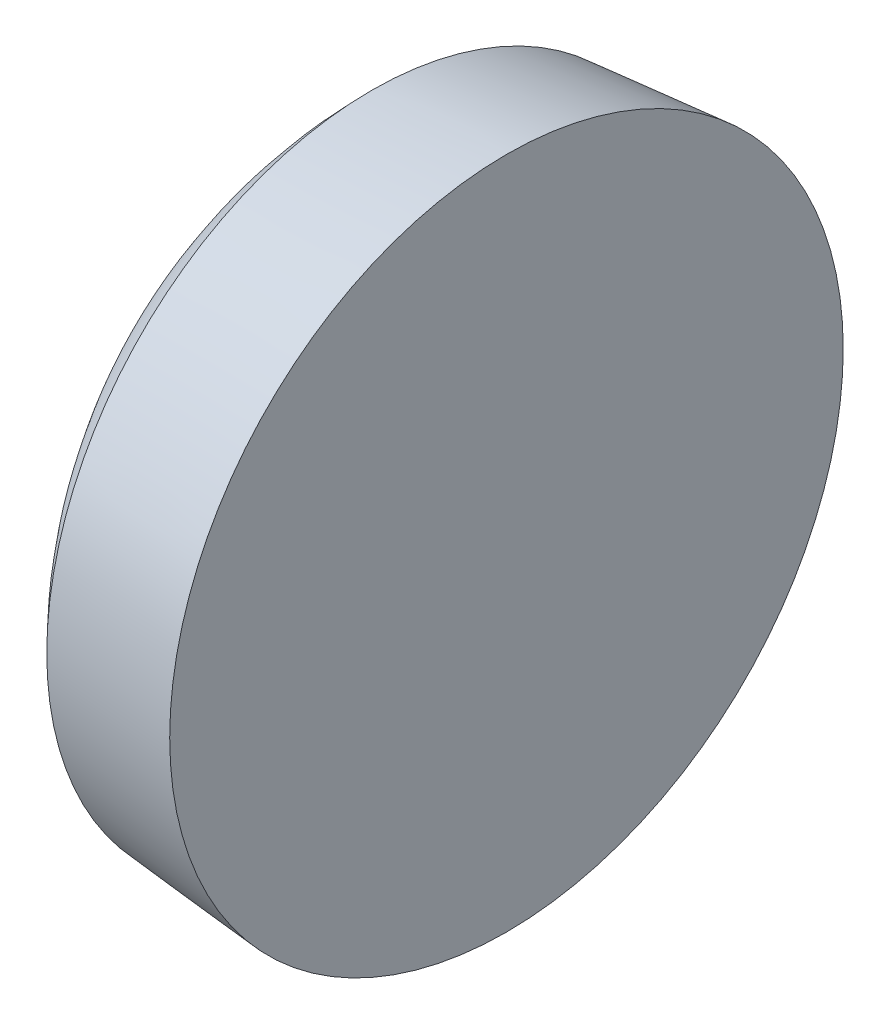
ISO-10303-21;
HEADER;
FILE_DESCRIPTION(('STEP AP214'),'2;1');
FILE_NAME('part.step','',(''),(''),'','','');
FILE_SCHEMA(('AUTOMOTIVE_DESIGN { 1 0 10303 214 1 1 1 1 }'));
ENDSEC;
DATA;
#1=APPLICATION_CONTEXT('core data for automotive mechanical design processes');
#2=APPLICATION_PROTOCOL_DEFINITION('international standard','automotive_design',2000,#1);
#3=PRODUCT_CONTEXT('',#1,'mechanical');
#4=PRODUCT('Part','Part','',(#3));
#5=PRODUCT_RELATED_PRODUCT_CATEGORY('part','',(#4));
#6=PRODUCT_DEFINITION_FORMATION('','',#4);
#7=PRODUCT_DEFINITION_CONTEXT('part definition',#1,'design');
#8=PRODUCT_DEFINITION('design','',#6,#7);
#9=PRODUCT_DEFINITION_SHAPE('','',#8);
#10=(LENGTH_UNIT() NAMED_UNIT(*) SI_UNIT(.MILLI.,.METRE.));
#11=(NAMED_UNIT(*) PLANE_ANGLE_UNIT() SI_UNIT($,.RADIAN.));
#12=(NAMED_UNIT(*) SI_UNIT($,.STERADIAN.) SOLID_ANGLE_UNIT());
#13=UNCERTAINTY_MEASURE_WITH_UNIT(LENGTH_MEASURE(1.E-05),#10,'distance_accuracy_value','');
#14=(GEOMETRIC_REPRESENTATION_CONTEXT(3) GLOBAL_UNCERTAINTY_ASSIGNED_CONTEXT((#13)) GLOBAL_UNIT_ASSIGNED_CONTEXT((#10,
#11,#12)) REPRESENTATION_CONTEXT('',''));
#15=CARTESIAN_POINT('',(0.,0.,0.));
#16=DIRECTION('',(0.,0.,1.));
#17=DIRECTION('',(1.,0.,0.));
#18=AXIS2_PLACEMENT_3D('',#15,#16,#17);
#19=CARTESIAN_POINT('',(176.066666666667,6.9,10.));
#20=DIRECTION('',(-1.,0.,0.));
#21=DIRECTION('',(0.,0.,1.));
#22=AXIS2_PLACEMENT_3D('',#19,#20,#21);
#23=PLANE('',#22);
#24=DIRECTION('',(0.,0.,-1.));
#25=VECTOR('',#24,1.);
#26=CARTESIAN_POINT('',(176.066666666667,7.85,10.));
#27=LINE('',#26,#25);
#28=CARTESIAN_POINT('',(176.066666666667,7.85,9.82));
#29=VERTEX_POINT('',#28);
#30=CARTESIAN_POINT('',(176.066666666667,7.85,10.18));
#31=VERTEX_POINT('',#30);
#32=EDGE_CURVE('E293',#29,#31,#27,.F.);
#33=ORIENTED_EDGE('',*,*,#32,.F.);
#34=DIRECTION('',(0.,1.,0.));
#35=VECTOR('',#34,1.);
#36=CARTESIAN_POINT('',(176.066666666667,6.9,9.82));
#37=LINE('',#36,#35);
#38=CARTESIAN_POINT('',(176.066666666667,7.08,9.82));
#39=VERTEX_POINT('',#38);
#40=EDGE_CURVE('E298',#39,#29,#37,.T.);
#41=ORIENTED_EDGE('',*,*,#40,.F.);
#42=DIRECTION('',(0.,0.,-1.));
#43=VECTOR('',#42,1.);
#44=CARTESIAN_POINT('',(176.066666666667,7.08,10.));
#45=LINE('',#44,#43);
#46=CARTESIAN_POINT('',(176.066666666667,7.08,9.05));
#47=VERTEX_POINT('',#46);
#48=EDGE_CURVE('E303',#47,#39,#45,.F.);
#49=ORIENTED_EDGE('',*,*,#48,.F.);
#50=DIRECTION('',(0.,1.,0.));
#51=VECTOR('',#50,1.);
#52=CARTESIAN_POINT('',(176.066666666667,6.9,9.05));
#53=LINE('',#52,#51);
#54=CARTESIAN_POINT('',(176.066666666667,6.72,9.05));
#55=VERTEX_POINT('',#54);
#56=EDGE_CURVE('E308',#55,#47,#53,.T.);
#57=ORIENTED_EDGE('',*,*,#56,.F.);
#58=DIRECTION('',(0.,0.,1.));
#59=VECTOR('',#58,1.);
#60=CARTESIAN_POINT('',(176.066666666667,6.72,10.));
#61=LINE('',#60,#59);
#62=CARTESIAN_POINT('',(176.066666666667,6.72,9.82));
#63=VERTEX_POINT('',#62);
#64=EDGE_CURVE('E313',#63,#55,#61,.F.);
#65=ORIENTED_EDGE('',*,*,#64,.F.);
#66=DIRECTION('',(0.,1.,0.));
#67=VECTOR('',#66,1.);
#68=CARTESIAN_POINT('',(176.066666666667,6.9,9.82));
#69=LINE('',#68,#67);
#70=CARTESIAN_POINT('',(176.066666666667,5.95,9.82));
#71=VERTEX_POINT('',#70);
#72=EDGE_CURVE('E318',#71,#63,#69,.T.);
#73=ORIENTED_EDGE('',*,*,#72,.F.);
#74=DIRECTION('',(0.,0.,-1.));
#75=VECTOR('',#74,1.);
#76=CARTESIAN_POINT('',(176.066666666667,5.95,10.));
#77=LINE('',#76,#75);
#78=CARTESIAN_POINT('',(176.066666666667,5.95,10.18));
#79=VERTEX_POINT('',#78);
#80=EDGE_CURVE('E267',#71,#79,#77,.F.);
#81=ORIENTED_EDGE('',*,*,#80,.T.);
#82=DIRECTION('',(0.,1.,0.));
#83=VECTOR('',#82,1.);
#84=CARTESIAN_POINT('',(176.066666666667,6.9,10.18));
#85=LINE('',#84,#83);
#86=CARTESIAN_POINT('',(176.066666666667,6.72,10.18));
#87=VERTEX_POINT('',#86);
#88=EDGE_CURVE('E264',#87,#79,#85,.F.);
#89=ORIENTED_EDGE('',*,*,#88,.F.);
#90=DIRECTION('',(0.,0.,1.));
#91=VECTOR('',#90,1.);
#92=CARTESIAN_POINT('',(176.066666666667,6.72,10.));
#93=LINE('',#92,#91);
#94=CARTESIAN_POINT('',(176.066666666667,6.72,10.95));
#95=VERTEX_POINT('',#94);
#96=EDGE_CURVE('E260',#95,#87,#93,.F.);
#97=ORIENTED_EDGE('',*,*,#96,.F.);
#98=DIRECTION('',(0.,1.,0.));
#99=VECTOR('',#98,1.);
#100=CARTESIAN_POINT('',(176.066666666667,6.9,10.95));
#101=LINE('',#100,#99);
#102=CARTESIAN_POINT('',(176.066666666667,7.08,10.95));
#103=VERTEX_POINT('',#102);
#104=EDGE_CURVE('E231',#95,#103,#101,.T.);
#105=ORIENTED_EDGE('',*,*,#104,.T.);
#106=DIRECTION('',(0.,0.,-1.));
#107=VECTOR('',#106,1.);
#108=CARTESIAN_POINT('',(176.066666666667,7.08,10.));
#109=LINE('',#108,#107);
#110=CARTESIAN_POINT('',(176.066666666667,7.08,10.18));
#111=VERTEX_POINT('',#110);
#112=EDGE_CURVE('E278',#111,#103,#109,.F.);
#113=ORIENTED_EDGE('',*,*,#112,.F.);
#114=DIRECTION('',(0.,1.,0.));
#115=VECTOR('',#114,1.);
#116=CARTESIAN_POINT('',(176.066666666667,6.9,10.18));
#117=LINE('',#116,#115);
#118=EDGE_CURVE('E288',#31,#111,#117,.F.);
#119=ORIENTED_EDGE('',*,*,#118,.F.);
#120=EDGE_LOOP('',(#33,#41,#49,#57,#65,#73,#81,#89,#97,#105,#113,#119));
#121=FACE_BOUND('',#120,.T.);
#122=ADVANCED_FACE('F17',(#121),#23,.T.);
#123=CARTESIAN_POINT('',(175.466666666667,6.72,10.));
#124=DIRECTION('',(0.,1.,0.));
#125=DIRECTION('',(0.,0.,1.));
#126=AXIS2_PLACEMENT_3D('',#123,#124,#125);
#127=PLANE('',#126);
#128=DIRECTION('',(1.,0.,0.));
#129=VECTOR('',#128,1.);
#130=CARTESIAN_POINT('',(175.466666666667,6.72,10.95));
#131=LINE('',#130,#129);
#132=CARTESIAN_POINT('',(175.043762143476,6.72,10.9500000000001));
#133=VERTEX_POINT('',#132);
#134=EDGE_CURVE('E89',#133,#95,#131,.T.);
#135=ORIENTED_EDGE('',*,*,#134,.T.);
#136=ORIENTED_EDGE('',*,*,#96,.T.);
#137=DIRECTION('',(-1.,0.,0.));
#138=VECTOR('',#137,1.);
#139=CARTESIAN_POINT('',(175.466666666667,6.72,10.18));
#140=LINE('',#139,#138);
#141=CARTESIAN_POINT('',(174.878569096873,6.71999999999999,10.18));
#142=VERTEX_POINT('',#141);
#143=EDGE_CURVE('E224',#142,#87,#140,.F.);
#144=ORIENTED_EDGE('',*,*,#143,.F.);
#145=CARTESIAN_POINT('',(175.043762143476,6.72,10.9500000000001));
#146=CARTESIAN_POINT('',(175.032217129282,6.72,10.9189995540507));
#147=CARTESIAN_POINT('',(175.021237746898,6.72,10.8877884938069));
#148=CARTESIAN_POINT('',(175.00046454836,6.72,10.825110453647));
#149=CARTESIAN_POINT('',(174.990666241349,6.72,10.7936449620742));
#150=CARTESIAN_POINT('',(174.972242700709,6.72,10.7304618501357));
#151=CARTESIAN_POINT('',(174.96361446108,6.72,10.6987451062673));
#152=CARTESIAN_POINT('',(174.947522711913,6.72,10.6350619663156));
#153=CARTESIAN_POINT('',(174.940057683091,6.72,10.6030959541243));
#154=CARTESIAN_POINT('',(174.926288504705,6.72,10.5389148788569));
#155=CARTESIAN_POINT('',(174.91998435514,6.72,10.5066998157809));
#156=CARTESIAN_POINT('',(174.908537607774,6.72,10.4420201537525));
#157=CARTESIAN_POINT('',(174.903396553029,6.72,10.4095552817086));
#158=CARTESIAN_POINT('',(174.894281504356,6.72,10.3443751591894));
#159=CARTESIAN_POINT('',(174.890310611427,6.72,10.3116594750373));
#160=CARTESIAN_POINT('',(174.883545624518,6.72,10.2459761632456));
#161=CARTESIAN_POINT('',(174.880756236699,6.72,10.2130080508538));
#162=CARTESIAN_POINT('',(174.878569096873,6.72,10.18));
#163=B_SPLINE_CURVE_WITH_KNOTS('',3,(#145,#146,#147,#148,#149,#150,#151,#152,#153,#154,#155,
#156,#157,#158,#159,#160,#161,#162),.UNSPECIFIED.,.F.,.F.,(4,2,2,2,2,2,2,2,4),(0.,
0.0992357442434378,0.198081387639297,0.296668072480536,0.39512489269415,0.493581712907769,
0.592168397749008,0.69101404114487,0.790249785388305),.UNSPECIFIED.);
#164=EDGE_CURVE('E20',#133,#142,#163,.T.);
#165=ORIENTED_EDGE('',*,*,#164,.F.);
#166=EDGE_LOOP('',(#135,#136,#144,#165));
#167=FACE_BOUND('',#166,.T.);
#168=ADVANCED_FACE('F221',(#167),#127,.T.);
#169=CARTESIAN_POINT('',(175.466666666667,6.9,10.18));
#170=DIRECTION('',(0.,0.,-1.));
#171=DIRECTION('',(-1.,0.,0.));
#172=AXIS2_PLACEMENT_3D('',#169,#170,#171);
#173=PLANE('',#172);
#174=ORIENTED_EDGE('',*,*,#88,.T.);
#175=DIRECTION('',(1.,0.,0.));
#176=VECTOR('',#175,1.);
#177=CARTESIAN_POINT('',(175.466666666667,5.95,10.18));
#178=LINE('',#177,#176);
#179=CARTESIAN_POINT('',(175.043762143476,5.95,10.18));
#180=VERTEX_POINT('',#179);
#181=EDGE_CURVE('E324',#79,#180,#178,.F.);
#182=ORIENTED_EDGE('',*,*,#181,.T.);
#183=CARTESIAN_POINT('',(174.878569096873,6.71999999999997,10.18));
#184=CARTESIAN_POINT('',(174.884223275561,6.63440991744415,10.18));
#185=CARTESIAN_POINT('',(174.893954762962,6.54909652262228,10.18));
#186=CARTESIAN_POINT('',(174.921321880478,6.38034093840227,10.18));
#187=CARTESIAN_POINT('',(174.938903434517,6.29688998051799,10.18));
#188=CARTESIAN_POINT('',(174.983632564079,6.12495750840946,10.18));
#189=CARTESIAN_POINT('',(175.011468627175,6.03665468899643,10.18));
#190=CARTESIAN_POINT('',(175.043762143476,5.94999999999987,10.18));
#191=B_SPLINE_CURVE_WITH_KNOTS('',3,(#183,#184,#185,#186,#187,#188,#189,#190),.UNSPECIFIED.,.F.,
.F.,(4,2,2,4),(0.,0.257221658829358,0.512698117737389,0.789983486231724),.UNSPECIFIED.);
#192=EDGE_CURVE('E213',#142,#180,#191,.T.);
#193=ORIENTED_EDGE('',*,*,#192,.F.);
#194=ORIENTED_EDGE('',*,*,#143,.T.);
#195=EDGE_LOOP('',(#174,#182,#193,#194));
#196=FACE_BOUND('',#195,.T.);
#197=ADVANCED_FACE('F204',(#196),#173,.T.);
#198=CARTESIAN_POINT('',(175.466666666667,5.95,10.));
#199=DIRECTION('',(0.,-1.,0.));
#200=DIRECTION('',(0.,0.,-1.));
#201=AXIS2_PLACEMENT_3D('',#198,#199,#200);
#202=PLANE('',#201);
#203=ORIENTED_EDGE('',*,*,#181,.F.);
#204=ORIENTED_EDGE('',*,*,#80,.F.);
#205=DIRECTION('',(1.,0.,0.));
#206=VECTOR('',#205,1.);
#207=CARTESIAN_POINT('',(175.466666666667,5.95,9.82));
#208=LINE('',#207,#206);
#209=CARTESIAN_POINT('',(175.043762143476,5.94999999999993,9.82));
#210=VERTEX_POINT('',#209);
#211=EDGE_CURVE('E320',#210,#71,#208,.T.);
#212=ORIENTED_EDGE('',*,*,#211,.F.);
#213=CARTESIAN_POINT('',(175.043762143476,5.95,10.18));
#214=CARTESIAN_POINT('',(175.039533747777,5.94999999999998,10.12));
#215=CARTESIAN_POINT('',(175.037419549928,5.94999999999998,10.06));
#216=CARTESIAN_POINT('',(175.037419549928,5.95000000000002,9.93999999999995));
#217=CARTESIAN_POINT('',(175.039533747777,5.95000000000006,9.87999999999993));
#218=CARTESIAN_POINT('',(175.043762143476,5.95000000000011,9.81999999999991));
#219=B_SPLINE_CURVE_WITH_KNOTS('',3,(#213,#214,#215,#216,#217,#218),.UNSPECIFIED.,.F.,.F.,(4,2,
4),(0.,0.180111711148745,0.36022342229749),.UNSPECIFIED.);
#220=EDGE_CURVE('E207',#180,#210,#219,.T.);
#221=ORIENTED_EDGE('',*,*,#220,.F.);
#222=EDGE_LOOP('',(#203,#204,#212,#221));
#223=FACE_BOUND('',#222,.T.);
#224=ADVANCED_FACE('F199',(#223),#202,.F.);
#225=CARTESIAN_POINT('',(175.466666666667,6.9,9.82));
#226=DIRECTION('',(0.,0.,1.));
#227=DIRECTION('',(1.,0.,0.));
#228=AXIS2_PLACEMENT_3D('',#225,#226,#227);
#229=PLANE('',#228);
#230=ORIENTED_EDGE('',*,*,#72,.T.);
#231=DIRECTION('',(1.,0.,0.));
#232=VECTOR('',#231,1.);
#233=CARTESIAN_POINT('',(175.466666666667,6.72,9.82));
#234=LINE('',#233,#232);
#235=CARTESIAN_POINT('',(174.878569096873,6.72,9.81999999999998));
#236=VERTEX_POINT('',#235);
#237=EDGE_CURVE('E315',#236,#63,#234,.T.);
#238=ORIENTED_EDGE('',*,*,#237,.F.);
#239=CARTESIAN_POINT('',(175.043762143476,5.94999999999987,9.82));
#240=CARTESIAN_POINT('',(175.032217129282,5.98100044594929,9.82));
#241=CARTESIAN_POINT('',(175.021237746898,6.01221150619315,9.82));
#242=CARTESIAN_POINT('',(175.00046454836,6.07488954635304,9.82));
#243=CARTESIAN_POINT('',(174.990666241349,6.10635503792584,9.82));
#244=CARTESIAN_POINT('',(174.972242700709,6.1695381498643,9.82));
#245=CARTESIAN_POINT('',(174.96361446108,6.20125489373266,9.82));
#246=CARTESIAN_POINT('',(174.947522711913,6.26493803368441,9.82));
#247=CARTESIAN_POINT('',(174.940057683091,6.29690404587573,9.82));
#248=CARTESIAN_POINT('',(174.926288504705,6.36108512114309,9.82));
#249=CARTESIAN_POINT('',(174.91998435514,6.39330018421913,9.82));
#250=CARTESIAN_POINT('',(174.908537607774,6.45797984624754,9.82));
#251=CARTESIAN_POINT('',(174.903396553029,6.49044471829137,9.82));
#252=CARTESIAN_POINT('',(174.894281504356,6.55562484081063,9.82));
#253=CARTESIAN_POINT('',(174.890310611427,6.58834052496272,9.82));
#254=CARTESIAN_POINT('',(174.883545624518,6.65402383675436,9.82));
#255=CARTESIAN_POINT('',(174.880756236699,6.68699194914618,9.82));
#256=CARTESIAN_POINT('',(174.878569096873,6.71999999999997,9.82));
#257=B_SPLINE_CURVE_WITH_KNOTS('',3,(#239,#240,#241,#242,#243,#244,#245,#246,#247,#248,#249,
#250,#251,#252,#253,#254,#255,#256),.UNSPECIFIED.,.F.,.F.,(4,2,2,2,2,2,2,2,4),(0.,
0.0992357442434386,0.1980813876393,0.296668072480538,0.395124892694152,0.493581712907769,
0.592168397749011,0.691014041144872,0.790249785388307),.UNSPECIFIED.);
#258=EDGE_CURVE('E184',#210,#236,#257,.T.);
#259=ORIENTED_EDGE('',*,*,#258,.F.);
#260=ORIENTED_EDGE('',*,*,#211,.T.);
#261=EDGE_LOOP('',(#230,#238,#259,#260));
#262=FACE_BOUND('',#261,.T.);
#263=ADVANCED_FACE('F194',(#262),#229,.T.);
#264=CARTESIAN_POINT('',(175.466666666667,6.72,10.));
#265=DIRECTION('',(0.,1.,0.));
#266=DIRECTION('',(0.,0.,1.));
#267=AXIS2_PLACEMENT_3D('',#264,#265,#266);
#268=PLANE('',#267);
#269=DIRECTION('',(1.,0.,0.));
#270=VECTOR('',#269,1.);
#271=CARTESIAN_POINT('',(175.466666666667,6.72,9.05));
#272=LINE('',#271,#270);
#273=CARTESIAN_POINT('',(175.043762143476,6.72,9.05));
#274=VERTEX_POINT('',#273);
#275=EDGE_CURVE('E310',#274,#55,#272,.T.);
#276=ORIENTED_EDGE('',*,*,#275,.F.);
#277=CARTESIAN_POINT('',(174.878569096873,6.72,9.81999999999997));
#278=CARTESIAN_POINT('',(174.884223275561,6.72,9.73440991744415));
#279=CARTESIAN_POINT('',(174.893954762962,6.72,9.64909652262228));
#280=CARTESIAN_POINT('',(174.921321880478,6.72,9.48034093840227));
#281=CARTESIAN_POINT('',(174.938903434517,6.72,9.39688998051799));
#282=CARTESIAN_POINT('',(174.983632564079,6.72,9.22495750840946));
#283=CARTESIAN_POINT('',(175.011468627175,6.72,9.13665468899643));
#284=CARTESIAN_POINT('',(175.043762143476,6.72,9.04999999999987));
#285=B_SPLINE_CURVE_WITH_KNOTS('',3,(#277,#278,#279,#280,#281,#282,#283,#284),.UNSPECIFIED.,.F.,
.F.,(4,2,2,4),(0.,0.257221658829358,0.512698117737392,0.78998348623172),.UNSPECIFIED.);
#286=EDGE_CURVE('E176',#236,#274,#285,.T.);
#287=ORIENTED_EDGE('',*,*,#286,.F.);
#288=ORIENTED_EDGE('',*,*,#237,.T.);
#289=ORIENTED_EDGE('',*,*,#64,.T.);
#290=EDGE_LOOP('',(#276,#287,#288,#289));
#291=FACE_BOUND('',#290,.T.);
#292=ADVANCED_FACE('F191',(#291),#268,.T.);
#293=CARTESIAN_POINT('',(175.466666666667,6.9,9.05));
#294=DIRECTION('',(0.,0.,1.));
#295=DIRECTION('',(1.,0.,0.));
#296=AXIS2_PLACEMENT_3D('',#293,#294,#295);
#297=PLANE('',#296);
#298=DIRECTION('',(1.,0.,0.));
#299=VECTOR('',#298,1.);
#300=CARTESIAN_POINT('',(175.466666666667,7.08,9.05));
#301=LINE('',#300,#299);
#302=CARTESIAN_POINT('',(175.043762143476,7.08,9.04999999999994));
#303=VERTEX_POINT('',#302);
#304=EDGE_CURVE('E305',#303,#47,#301,.T.);
#305=ORIENTED_EDGE('',*,*,#304,.F.);
#306=CARTESIAN_POINT('',(175.043762143476,7.08,9.05));
#307=CARTESIAN_POINT('',(175.037419549928,6.99011174581202,9.05));
#308=CARTESIAN_POINT('',(175.037419549928,6.9,9.05));
#309=B_SPLINE_CURVE_WITH_KNOTS('',2,(#306,#307,#308),.UNSPECIFIED.,.F.,.F.,(3,3),(0.,1.),.UNSPECIFIED.);
#310=CARTESIAN_POINT('',(175.037419549928,6.9,9.05));
#311=VERTEX_POINT('',#310);
#312=EDGE_CURVE('E175',#311,#303,#309,.F.);
#313=ORIENTED_EDGE('',*,*,#312,.F.);
#314=CARTESIAN_POINT('',(175.037419549928,6.9,9.05));
#315=CARTESIAN_POINT('',(175.037419549928,6.80988825418797,9.05));
#316=CARTESIAN_POINT('',(175.043762143476,6.72,9.05));
#317=B_SPLINE_CURVE_WITH_KNOTS('',2,(#314,#315,#316),.UNSPECIFIED.,.F.,.F.,(3,3),(0.,1.),.UNSPECIFIED.);
#318=EDGE_CURVE('E183',#274,#311,#317,.F.);
#319=ORIENTED_EDGE('',*,*,#318,.F.);
#320=ORIENTED_EDGE('',*,*,#275,.T.);
#321=ORIENTED_EDGE('',*,*,#56,.T.);
#322=EDGE_LOOP('',(#305,#313,#319,#320,#321));
#323=FACE_BOUND('',#322,.T.);
#324=ADVANCED_FACE('F164',(#323),#297,.T.);
#325=CARTESIAN_POINT('',(175.466666666667,7.08,10.));
#326=DIRECTION('',(0.,-1.,0.));
#327=DIRECTION('',(0.,0.,-1.));
#328=AXIS2_PLACEMENT_3D('',#325,#326,#327);
#329=PLANE('',#328);
#330=ORIENTED_EDGE('',*,*,#304,.T.);
#331=ORIENTED_EDGE('',*,*,#48,.T.);
#332=DIRECTION('',(1.,0.,0.));
#333=VECTOR('',#332,1.);
#334=CARTESIAN_POINT('',(175.466666666667,7.08,9.82));
#335=LINE('',#334,#333);
#336=CARTESIAN_POINT('',(174.878569096873,7.08000000000002,9.82));
#337=VERTEX_POINT('',#336);
#338=EDGE_CURVE('E300',#337,#39,#335,.T.);
#339=ORIENTED_EDGE('',*,*,#338,.F.);
#340=CARTESIAN_POINT('',(175.043762143476,7.08,9.04999999999987));
#341=CARTESIAN_POINT('',(175.032217129282,7.08,9.08100044594929));
#342=CARTESIAN_POINT('',(175.021237746898,7.08,9.11221150619315));
#343=CARTESIAN_POINT('',(175.00046454836,7.08,9.17488954635304));
#344=CARTESIAN_POINT('',(174.990666241349,7.08,9.20635503792584));
#345=CARTESIAN_POINT('',(174.972242700709,7.08,9.2695381498643));
#346=CARTESIAN_POINT('',(174.96361446108,7.08,9.30125489373266));
#347=CARTESIAN_POINT('',(174.947522711913,7.08,9.36493803368441));
#348=CARTESIAN_POINT('',(174.940057683091,7.08,9.39690404587573));
#349=CARTESIAN_POINT('',(174.926288504705,7.08,9.46108512114309));
#350=CARTESIAN_POINT('',(174.91998435514,7.08,9.49330018421913));
#351=CARTESIAN_POINT('',(174.908537607774,7.08,9.55797984624754));
#352=CARTESIAN_POINT('',(174.903396553029,7.08,9.59044471829137));
#353=CARTESIAN_POINT('',(174.894281504356,7.08,9.65562484081063));
#354=CARTESIAN_POINT('',(174.890310611427,7.08,9.68834052496272));
#355=CARTESIAN_POINT('',(174.883545624518,7.08,9.75402383675435));
#356=CARTESIAN_POINT('',(174.880756236699,7.08,9.78699194914618));
#357=CARTESIAN_POINT('',(174.878569096873,7.08,9.81999999999997));
#358=B_SPLINE_CURVE_WITH_KNOTS('',3,(#340,#341,#342,#343,#344,#345,#346,#347,#348,#349,#350,
#351,#352,#353,#354,#355,#356,#357),.UNSPECIFIED.,.F.,.F.,(4,2,2,2,2,2,2,2,4),(0.,
0.0992357442434378,0.198081387639297,0.296668072480536,0.39512489269415,0.49358171290777,
0.592168397749008,0.691014041144872,0.790249785388305),.UNSPECIFIED.);
#359=EDGE_CURVE('E168',#303,#337,#358,.T.);
#360=ORIENTED_EDGE('',*,*,#359,.F.);
#361=EDGE_LOOP('',(#330,#331,#339,#360));
#362=FACE_BOUND('',#361,.T.);
#363=ADVANCED_FACE('F159',(#362),#329,.T.);
#364=CARTESIAN_POINT('',(175.466666666667,6.9,9.82));
#365=DIRECTION('',(0.,0.,1.));
#366=DIRECTION('',(1.,0.,0.));
#367=AXIS2_PLACEMENT_3D('',#364,#365,#366);
#368=PLANE('',#367);
#369=ORIENTED_EDGE('',*,*,#40,.T.);
#370=DIRECTION('',(1.,0.,0.));
#371=VECTOR('',#370,1.);
#372=CARTESIAN_POINT('',(175.466666666667,7.85,9.82));
#373=LINE('',#372,#371);
#374=CARTESIAN_POINT('',(175.043762143476,7.85,9.81999999999998));
#375=VERTEX_POINT('',#374);
#376=EDGE_CURVE('E295',#375,#29,#373,.T.);
#377=ORIENTED_EDGE('',*,*,#376,.F.);
#378=CARTESIAN_POINT('',(174.878569096873,7.08000000000003,9.82));
#379=CARTESIAN_POINT('',(174.884223275561,7.16559008255585,9.82));
#380=CARTESIAN_POINT('',(174.893954762962,7.25090347737773,9.82));
#381=CARTESIAN_POINT('',(174.921321880478,7.41965906159774,9.82));
#382=CARTESIAN_POINT('',(174.938903434517,7.50311001948201,9.82));
#383=CARTESIAN_POINT('',(174.983632564079,7.67504249159054,9.82));
#384=CARTESIAN_POINT('',(175.011468627175,7.76334531100356,9.82));
#385=CARTESIAN_POINT('',(175.043762143476,7.85000000000013,9.82));
#386=B_SPLINE_CURVE_WITH_KNOTS('',3,(#378,#379,#380,#381,#382,#383,#384,#385),.UNSPECIFIED.,.F.,
.F.,(4,2,2,4),(0.,0.25722165882936,0.512698117737392,0.789983486231716),.UNSPECIFIED.);
#387=EDGE_CURVE('E144',#337,#375,#386,.T.);
#388=ORIENTED_EDGE('',*,*,#387,.F.);
#389=ORIENTED_EDGE('',*,*,#338,.T.);
#390=EDGE_LOOP('',(#369,#377,#388,#389));
#391=FACE_BOUND('',#390,.T.);
#392=ADVANCED_FACE('F154',(#391),#368,.T.);
#393=CARTESIAN_POINT('',(175.466666666667,7.85,10.));
#394=DIRECTION('',(0.,-1.,0.));
#395=DIRECTION('',(0.,0.,-1.));
#396=AXIS2_PLACEMENT_3D('',#393,#394,#395);
#397=PLANE('',#396);
#398=ORIENTED_EDGE('',*,*,#32,.T.);
#399=DIRECTION('',(-1.,0.,0.));
#400=VECTOR('',#399,1.);
#401=CARTESIAN_POINT('',(175.466666666667,7.85,10.18));
#402=LINE('',#401,#400);
#403=CARTESIAN_POINT('',(175.043762143476,7.85000000000007,10.18));
#404=VERTEX_POINT('',#403);
#405=EDGE_CURVE('E290',#404,#31,#402,.F.);
#406=ORIENTED_EDGE('',*,*,#405,.F.);
#407=CARTESIAN_POINT('',(175.043762143476,7.85,9.81999999999998));
#408=CARTESIAN_POINT('',(175.039533747777,7.85000000000001,9.88));
#409=CARTESIAN_POINT('',(175.037419549928,7.85000000000001,9.94000000000001));
#410=CARTESIAN_POINT('',(175.037419549928,7.84999999999999,10.0600000000001));
#411=CARTESIAN_POINT('',(175.039533747777,7.84999999999997,10.1200000000001));
#412=CARTESIAN_POINT('',(175.043762143476,7.84999999999994,10.1800000000001));
#413=B_SPLINE_CURVE_WITH_KNOTS('',3,(#407,#408,#409,#410,#411,#412),.UNSPECIFIED.,.F.,.F.,(4,2,
4),(0.,0.180111711148747,0.360223422297492),.UNSPECIFIED.);
#414=EDGE_CURVE('E137',#375,#404,#413,.T.);
#415=ORIENTED_EDGE('',*,*,#414,.F.);
#416=ORIENTED_EDGE('',*,*,#376,.T.);
#417=EDGE_LOOP('',(#398,#406,#415,#416));
#418=FACE_BOUND('',#417,.T.);
#419=ADVANCED_FACE('F151',(#418),#397,.T.);
#420=CARTESIAN_POINT('',(175.466666666667,6.9,10.18));
#421=DIRECTION('',(0.,0.,-1.));
#422=DIRECTION('',(-1.,0.,0.));
#423=AXIS2_PLACEMENT_3D('',#420,#421,#422);
#424=PLANE('',#423);
#425=ORIENTED_EDGE('',*,*,#118,.T.);
#426=DIRECTION('',(1.,0.,0.));
#427=VECTOR('',#426,1.);
#428=CARTESIAN_POINT('',(175.466666666667,7.08,10.18));
#429=LINE('',#428,#427);
#430=CARTESIAN_POINT('',(174.878569096873,7.08,10.18));
#431=VERTEX_POINT('',#430);
#432=EDGE_CURVE('E280',#431,#111,#429,.T.);
#433=ORIENTED_EDGE('',*,*,#432,.F.);
#434=CARTESIAN_POINT('',(175.043762143476,7.85000000000013,10.18));
#435=CARTESIAN_POINT('',(175.032217129282,7.81899955405071,10.18));
#436=CARTESIAN_POINT('',(175.021237746898,7.78778849380685,10.18));
#437=CARTESIAN_POINT('',(175.00046454836,7.72511045364696,10.18));
#438=CARTESIAN_POINT('',(174.990666241349,7.69364496207416,10.18));
#439=CARTESIAN_POINT('',(174.972242700709,7.6304618501357,10.18));
#440=CARTESIAN_POINT('',(174.96361446108,7.59874510626734,10.18));
#441=CARTESIAN_POINT('',(174.947522711913,7.53506196631559,10.18));
#442=CARTESIAN_POINT('',(174.940057683091,7.50309595412427,10.18));
#443=CARTESIAN_POINT('',(174.926288504705,7.43891487885691,10.18));
#444=CARTESIAN_POINT('',(174.91998435514,7.40669981578087,10.18));
#445=CARTESIAN_POINT('',(174.908537607774,7.34202015375246,10.18));
#446=CARTESIAN_POINT('',(174.903396553029,7.30955528170863,10.18));
#447=CARTESIAN_POINT('',(174.894281504356,7.24437515918937,10.18));
#448=CARTESIAN_POINT('',(174.890310611427,7.21165947503728,10.18));
#449=CARTESIAN_POINT('',(174.883545624518,7.14597616324565,10.18));
#450=CARTESIAN_POINT('',(174.880756236699,7.11300805085382,10.18));
#451=CARTESIAN_POINT('',(174.878569096873,7.08000000000003,10.18));
#452=B_SPLINE_CURVE_WITH_KNOTS('',3,(#434,#435,#436,#437,#438,#439,#440,#441,#442,#443,#444,
#445,#446,#447,#448,#449,#450,#451),.UNSPECIFIED.,.F.,.F.,(4,2,2,2,2,2,2,2,4),(0.,
0.0992357442434378,0.198081387639298,0.296668072480535,0.395124892694149,0.493581712907766,
0.592168397749007,0.691014041144869,0.790249785388302),.UNSPECIFIED.);
#453=EDGE_CURVE('E100',#404,#431,#452,.T.);
#454=ORIENTED_EDGE('',*,*,#453,.F.);
#455=ORIENTED_EDGE('',*,*,#405,.T.);
#456=EDGE_LOOP('',(#425,#433,#454,#455));
#457=FACE_BOUND('',#456,.T.);
#458=ADVANCED_FACE('F123',(#457),#424,.T.);
#459=CARTESIAN_POINT('',(175.466666666667,7.08,10.));
#460=DIRECTION('',(0.,-1.,0.));
#461=DIRECTION('',(0.,0.,-1.));
#462=AXIS2_PLACEMENT_3D('',#459,#460,#461);
#463=PLANE('',#462);
#464=DIRECTION('',(1.,0.,0.));
#465=VECTOR('',#464,1.);
#466=CARTESIAN_POINT('',(175.466666666667,7.08,10.95));
#467=LINE('',#466,#465);
#468=CARTESIAN_POINT('',(175.043762143476,7.08,10.95));
#469=VERTEX_POINT('',#468);
#470=EDGE_CURVE('E40',#103,#469,#467,.F.);
#471=ORIENTED_EDGE('',*,*,#470,.T.);
#472=CARTESIAN_POINT('',(174.878569096873,7.08,10.18));
#473=CARTESIAN_POINT('',(174.884223275561,7.08,10.2655900825559));
#474=CARTESIAN_POINT('',(174.893954762962,7.08,10.3509034773777));
#475=CARTESIAN_POINT('',(174.921321880478,7.08,10.5196590615977));
#476=CARTESIAN_POINT('',(174.938903434517,7.08,10.603110019482));
#477=CARTESIAN_POINT('',(174.983632564079,7.08,10.7750424915905));
#478=CARTESIAN_POINT('',(175.011468627175,7.08,10.8633453110036));
#479=CARTESIAN_POINT('',(175.043762143476,7.08,10.9500000000001));
#480=B_SPLINE_CURVE_WITH_KNOTS('',3,(#472,#473,#474,#475,#476,#477,#478,#479),.UNSPECIFIED.,.F.,
.F.,(4,2,2,4),(0.,0.257221658829358,0.512698117737393,0.789983486231719),.UNSPECIFIED.);
#481=EDGE_CURVE('E96',#431,#469,#480,.T.);
#482=ORIENTED_EDGE('',*,*,#481,.F.);
#483=ORIENTED_EDGE('',*,*,#432,.T.);
#484=ORIENTED_EDGE('',*,*,#112,.T.);
#485=EDGE_LOOP('',(#471,#482,#483,#484));
#486=FACE_BOUND('',#485,.T.);
#487=ADVANCED_FACE('F115',(#486),#463,.T.);
#488=CARTESIAN_POINT('',(175.466666666667,6.9,10.95));
#489=DIRECTION('',(0.,0.,1.));
#490=DIRECTION('',(1.,0.,0.));
#491=AXIS2_PLACEMENT_3D('',#488,#489,#490);
#492=PLANE('',#491);
#493=ORIENTED_EDGE('',*,*,#470,.F.);
#494=ORIENTED_EDGE('',*,*,#104,.F.);
#495=ORIENTED_EDGE('',*,*,#134,.F.);
#496=CARTESIAN_POINT('',(175.037419549928,6.9,10.95));
#497=CARTESIAN_POINT('',(175.037419549928,6.80988825418797,10.95));
#498=CARTESIAN_POINT('',(175.043762143476,6.72,10.95));
#499=B_SPLINE_CURVE_WITH_KNOTS('',2,(#496,#497,#498),.UNSPECIFIED.,.F.,.F.,(3,3),(0.,1.),.UNSPECIFIED.);
#500=CARTESIAN_POINT('',(175.037419549928,6.9,10.95));
#501=VERTEX_POINT('',#500);
#502=EDGE_CURVE('E82',#501,#133,#499,.T.);
#503=ORIENTED_EDGE('',*,*,#502,.F.);
#504=CARTESIAN_POINT('',(175.043762143476,7.08,10.95));
#505=CARTESIAN_POINT('',(175.037419549928,6.99011174581202,10.95));
#506=CARTESIAN_POINT('',(175.037419549928,6.9,10.95));
#507=B_SPLINE_CURVE_WITH_KNOTS('',2,(#504,#505,#506),.UNSPECIFIED.,.F.,.F.,(3,3),(0.,1.),.UNSPECIFIED.);
#508=EDGE_CURVE('E85',#469,#501,#507,.T.);
#509=ORIENTED_EDGE('',*,*,#508,.F.);
#510=EDGE_LOOP('',(#493,#494,#495,#503,#509));
#511=FACE_BOUND('',#510,.T.);
#512=ADVANCED_FACE('F84',(#511),#492,.F.);
#513=CARTESIAN_POINT('',(177.594751046113,6.9,10.));
#514=DIRECTION('',(1.,0.,0.));
#515=DIRECTION('',(0.,1.,0.));
#516=AXIS2_PLACEMENT_3D('',#513,#514,#515);
#517=SPHERICAL_SURFACE('',#516,2.72808437944638);
#518=CARTESIAN_POINT('',(175.666666666643,6.9,10.));
#519=DIRECTION('',(1.,0.,0.));
#520=DIRECTION('',(0.,0.,1.));
#521=AXIS2_PLACEMENT_3D('',#518,#519,#520);
#522=CIRCLE('',#521,1.93000906918229);
#523=CARTESIAN_POINT('',(175.666666666643,6.90000000000007,11.9300090691823));
#524=VERTEX_POINT('',#523);
#525=EDGE_CURVE('E31',#524,#524,#522,.T.);
#526=ORIENTED_EDGE('',*,*,#525,.F.);
#527=EDGE_LOOP('',(#526));
#528=FACE_BOUND('',#527,.T.);
#529=ORIENTED_EDGE('',*,*,#481,.T.);
#530=ORIENTED_EDGE('',*,*,#508,.T.);
#531=ORIENTED_EDGE('',*,*,#502,.T.);
#532=ORIENTED_EDGE('',*,*,#164,.T.);
#533=ORIENTED_EDGE('',*,*,#192,.T.);
#534=ORIENTED_EDGE('',*,*,#220,.T.);
#535=ORIENTED_EDGE('',*,*,#258,.T.);
#536=ORIENTED_EDGE('',*,*,#286,.T.);
#537=ORIENTED_EDGE('',*,*,#318,.T.);
#538=ORIENTED_EDGE('',*,*,#312,.T.);
#539=ORIENTED_EDGE('',*,*,#359,.T.);
#540=ORIENTED_EDGE('',*,*,#387,.T.);
#541=ORIENTED_EDGE('',*,*,#414,.T.);
#542=ORIENTED_EDGE('',*,*,#453,.T.);
#543=EDGE_LOOP('',(#529,#530,#531,#532,#533,#534,#535,#536,#537,#538,#539,#540,#541,#542));
#544=FACE_BOUND('',#543,.T.);
#545=ADVANCED_FACE('F94',(#528,#544),#517,.T.);
#546=CARTESIAN_POINT('',(176.46666666667,6.9,10.));
#547=DIRECTION('',(1.,0.,0.));
#548=DIRECTION('',(0.,0.,-1.));
#549=AXIS2_PLACEMENT_3D('',#546,#547,#548);
#550=CONICAL_SURFACE('',#549,2.00000000000045,0.0872664625936403);
#551=CARTESIAN_POINT('',(176.46666666667,6.9,10.));
#552=DIRECTION('',(1.,0.,0.));
#553=DIRECTION('',(0.,0.,-1.));
#554=AXIS2_PLACEMENT_3D('',#551,#552,#553);
#555=CIRCLE('',#554,2.00000000000045);
#556=CARTESIAN_POINT('',(176.46666666667,6.9,7.99999999999955));
#557=VERTEX_POINT('',#556);
#558=EDGE_CURVE('E11',#557,#557,#555,.T.);
#559=ORIENTED_EDGE('',*,*,#558,.F.);
#560=EDGE_LOOP('',(#559));
#561=FACE_BOUND('',#560,.T.);
#562=ORIENTED_EDGE('',*,*,#525,.T.);
#563=EDGE_LOOP('',(#562));
#564=FACE_BOUND('',#563,.T.);
#565=ADVANCED_FACE('F402',(#561,#564),#550,.T.);
#566=CARTESIAN_POINT('',(176.466666666667,6.9,11.));
#567=DIRECTION('',(1.,0.,0.));
#568=DIRECTION('',(0.,0.,-1.));
#569=AXIS2_PLACEMENT_3D('',#566,#567,#568);
#570=PLANE('',#569);
#571=ORIENTED_EDGE('',*,*,#558,.T.);
#572=EDGE_LOOP('',(#571));
#573=FACE_BOUND('',#572,.T.);
#574=ADVANCED_FACE('F400',(#573),#570,.T.);
#575=CLOSED_SHELL('',(#122,#168,#197,#224,#263,#292,#324,#363,#392,#419,#458,#487,#512,#545,
#565,#574));
#576=MANIFOLD_SOLID_BREP('B1',#575);
#577=ADVANCED_BREP_SHAPE_REPRESENTATION('',(#18,#576),#14);
#578=SHAPE_DEFINITION_REPRESENTATION(#9,#577);
ENDSEC;
END-ISO-10303-21;
